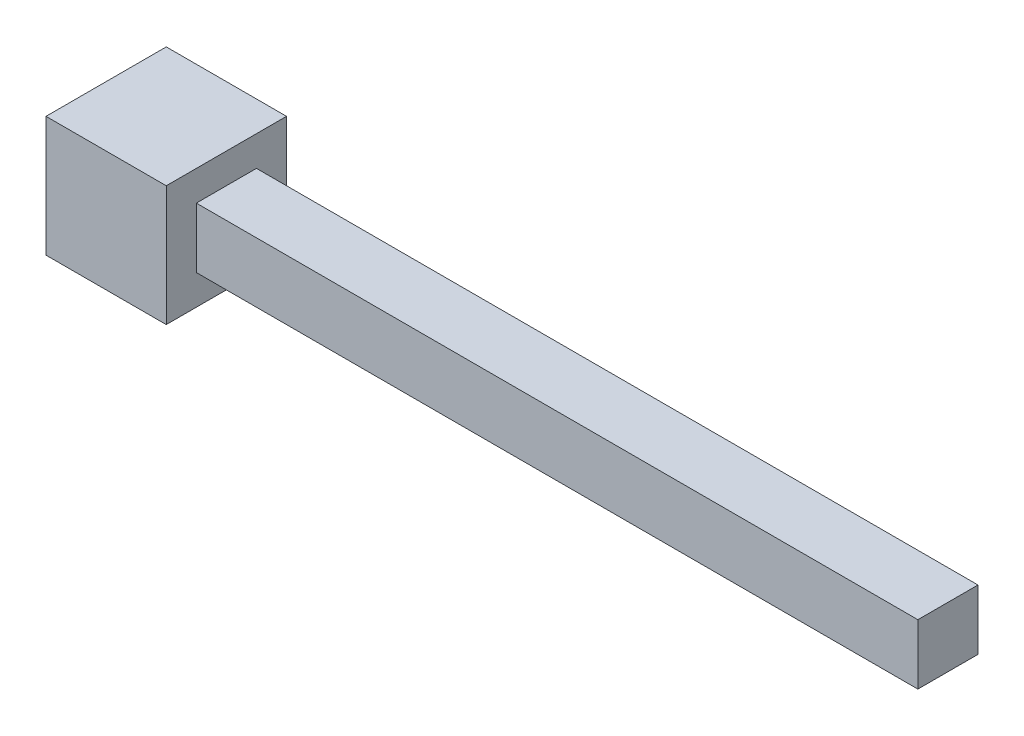
ISO-10303-21;
HEADER;
FILE_DESCRIPTION(('STEP AP214'),'2;1');
FILE_NAME('part.step','',(''),(''),'','','');
FILE_SCHEMA(('AUTOMOTIVE_DESIGN { 1 0 10303 214 1 1 1 1 }'));
ENDSEC;
DATA;
#1=APPLICATION_CONTEXT('core data for automotive mechanical design processes');
#2=APPLICATION_PROTOCOL_DEFINITION('international standard','automotive_design',2000,#1);
#3=PRODUCT_CONTEXT('',#1,'mechanical');
#4=PRODUCT('Part','Part','',(#3));
#5=PRODUCT_RELATED_PRODUCT_CATEGORY('part','',(#4));
#6=PRODUCT_DEFINITION_FORMATION('','',#4);
#7=PRODUCT_DEFINITION_CONTEXT('part definition',#1,'design');
#8=PRODUCT_DEFINITION('design','',#6,#7);
#9=PRODUCT_DEFINITION_SHAPE('','',#8);
#10=(LENGTH_UNIT() NAMED_UNIT(*) SI_UNIT(.MILLI.,.METRE.));
#11=(NAMED_UNIT(*) PLANE_ANGLE_UNIT() SI_UNIT($,.RADIAN.));
#12=(NAMED_UNIT(*) SI_UNIT($,.STERADIAN.) SOLID_ANGLE_UNIT());
#13=UNCERTAINTY_MEASURE_WITH_UNIT(LENGTH_MEASURE(1.E-05),#10,'distance_accuracy_value','');
#14=(GEOMETRIC_REPRESENTATION_CONTEXT(3) GLOBAL_UNCERTAINTY_ASSIGNED_CONTEXT((#13)) GLOBAL_UNIT_ASSIGNED_CONTEXT((#10,
#11,#12)) REPRESENTATION_CONTEXT('',''));
#15=CARTESIAN_POINT('',(0.,0.,0.));
#16=DIRECTION('',(0.,0.,1.));
#17=DIRECTION('',(1.,0.,0.));
#18=AXIS2_PLACEMENT_3D('',#15,#16,#17);
#19=CARTESIAN_POINT('',(-38.1,-11.0963113985984,25.4));
#20=DIRECTION('',(-1.,0.,0.));
#21=DIRECTION('',(0.,0.,1.));
#22=AXIS2_PLACEMENT_3D('',#19,#20,#21);
#23=PLANE('',#22);
#24=DIRECTION('',(0.,1.,0.));
#25=VECTOR('',#24,1.);
#26=CARTESIAN_POINT('',(-38.1,-11.0963113985984,0.));
#27=LINE('',#26,#25);
#28=CARTESIAN_POINT('',(-38.1,-11.0963113985984,0.));
#29=VERTEX_POINT('',#28);
#30=CARTESIAN_POINT('',(-38.1,14.3036886014016,0.));
#31=VERTEX_POINT('',#30);
#32=EDGE_CURVE('E124',#29,#31,#27,.T.);
#33=ORIENTED_EDGE('',*,*,#32,.T.);
#34=DIRECTION('',(0.,0.,-1.));
#35=VECTOR('',#34,1.);
#36=CARTESIAN_POINT('',(-38.1,14.3036886014016,25.4));
#37=LINE('',#36,#35);
#38=CARTESIAN_POINT('',(-38.1,14.3036886014016,25.4));
#39=VERTEX_POINT('',#38);
#40=EDGE_CURVE('E11',#39,#31,#37,.T.);
#41=ORIENTED_EDGE('',*,*,#40,.F.);
#42=DIRECTION('',(0.,1.,0.));
#43=VECTOR('',#42,1.);
#44=CARTESIAN_POINT('',(-38.1,-11.0963113985984,25.4));
#45=LINE('',#44,#43);
#46=CARTESIAN_POINT('',(-38.1,-11.0963113985984,25.4));
#47=VERTEX_POINT('',#46);
#48=EDGE_CURVE('E133',#47,#39,#45,.T.);
#49=ORIENTED_EDGE('',*,*,#48,.F.);
#50=DIRECTION('',(0.,0.,-1.));
#51=VECTOR('',#50,1.);
#52=CARTESIAN_POINT('',(-38.1,-11.0963113985984,25.4));
#53=LINE('',#52,#51);
#54=EDGE_CURVE('E142',#47,#29,#53,.T.);
#55=ORIENTED_EDGE('',*,*,#54,.T.);
#56=EDGE_LOOP('',(#33,#41,#49,#55));
#57=FACE_BOUND('',#56,.T.);
#58=DIRECTION('',(0.,1.,0.));
#59=VECTOR('',#58,1.);
#60=CARTESIAN_POINT('',(-38.1,-4.74631139859837,6.35));
#61=LINE('',#60,#59);
#62=CARTESIAN_POINT('',(-38.1,-4.74631139859837,6.35));
#63=VERTEX_POINT('',#62);
#64=CARTESIAN_POINT('',(-38.1,7.95368860140163,6.35));
#65=VERTEX_POINT('',#64);
#66=EDGE_CURVE('E54',#63,#65,#61,.T.);
#67=ORIENTED_EDGE('',*,*,#66,.F.);
#68=DIRECTION('',(0.,0.,-1.));
#69=VECTOR('',#68,1.);
#70=CARTESIAN_POINT('',(-38.1,-4.74631139859837,19.05));
#71=LINE('',#70,#69);
#72=CARTESIAN_POINT('',(-38.1,-4.74631139859837,19.05));
#73=VERTEX_POINT('',#72);
#74=EDGE_CURVE('E58',#73,#63,#71,.T.);
#75=ORIENTED_EDGE('',*,*,#74,.F.);
#76=DIRECTION('',(0.,-1.,0.));
#77=VECTOR('',#76,1.);
#78=CARTESIAN_POINT('',(-38.1,-4.74631139859837,19.05));
#79=LINE('',#78,#77);
#80=CARTESIAN_POINT('',(-38.1,7.95368860140163,19.05));
#81=VERTEX_POINT('',#80);
#82=EDGE_CURVE('E267',#81,#73,#79,.T.);
#83=ORIENTED_EDGE('',*,*,#82,.F.);
#84=DIRECTION('',(0.,0.,1.));
#85=VECTOR('',#84,1.);
#86=CARTESIAN_POINT('',(-38.1,7.95368860140163,19.05));
#87=LINE('',#86,#85);
#88=EDGE_CURVE('E273',#65,#81,#87,.T.);
#89=ORIENTED_EDGE('',*,*,#88,.F.);
#90=EDGE_LOOP('',(#67,#75,#83,#89));
#91=FACE_BOUND('',#90,.T.);
#92=ADVANCED_FACE('F40',(#57,#91),#23,.F.);
#93=CARTESIAN_POINT('',(-63.5,14.3036886014016,25.4));
#94=DIRECTION('',(0.,-1.,0.));
#95=DIRECTION('',(0.,0.,-1.));
#96=AXIS2_PLACEMENT_3D('',#93,#94,#95);
#97=PLANE('',#96);
#98=DIRECTION('',(-1.,0.,0.));
#99=VECTOR('',#98,1.);
#100=CARTESIAN_POINT('',(-63.5,14.3036886014016,0.));
#101=LINE('',#100,#99);
#102=CARTESIAN_POINT('',(-63.5,14.3036886014016,0.));
#103=VERTEX_POINT('',#102);
#104=EDGE_CURVE('E127',#31,#103,#101,.T.);
#105=ORIENTED_EDGE('',*,*,#104,.T.);
#106=DIRECTION('',(0.,0.,-1.));
#107=VECTOR('',#106,1.);
#108=CARTESIAN_POINT('',(-63.5,14.3036886014016,25.4));
#109=LINE('',#108,#107);
#110=CARTESIAN_POINT('',(-63.5,14.3036886014016,25.4));
#111=VERTEX_POINT('',#110);
#112=EDGE_CURVE('E47',#111,#103,#109,.T.);
#113=ORIENTED_EDGE('',*,*,#112,.F.);
#114=DIRECTION('',(-1.,0.,0.));
#115=VECTOR('',#114,1.);
#116=CARTESIAN_POINT('',(-63.5,14.3036886014016,25.4));
#117=LINE('',#116,#115);
#118=EDGE_CURVE('E136',#39,#111,#117,.T.);
#119=ORIENTED_EDGE('',*,*,#118,.F.);
#120=ORIENTED_EDGE('',*,*,#40,.T.);
#121=EDGE_LOOP('',(#105,#113,#119,#120));
#122=FACE_BOUND('',#121,.T.);
#123=ADVANCED_FACE('F173',(#122),#97,.F.);
#124=CARTESIAN_POINT('',(-63.5,-11.0963113985984,25.4));
#125=DIRECTION('',(1.,0.,0.));
#126=DIRECTION('',(0.,0.,-1.));
#127=AXIS2_PLACEMENT_3D('',#124,#125,#126);
#128=PLANE('',#127);
#129=DIRECTION('',(0.,-1.,0.));
#130=VECTOR('',#129,1.);
#131=CARTESIAN_POINT('',(-63.5,-11.0963113985984,0.));
#132=LINE('',#131,#130);
#133=CARTESIAN_POINT('',(-63.5,-11.0963113985984,0.));
#134=VERTEX_POINT('',#133);
#135=EDGE_CURVE('E145',#103,#134,#132,.T.);
#136=ORIENTED_EDGE('',*,*,#135,.T.);
#137=DIRECTION('',(0.,0.,-1.));
#138=VECTOR('',#137,1.);
#139=CARTESIAN_POINT('',(-63.5,-11.0963113985984,25.4));
#140=LINE('',#139,#138);
#141=CARTESIAN_POINT('',(-63.5,-11.0963113985984,25.4));
#142=VERTEX_POINT('',#141);
#143=EDGE_CURVE('E150',#142,#134,#140,.T.);
#144=ORIENTED_EDGE('',*,*,#143,.F.);
#145=DIRECTION('',(0.,-1.,0.));
#146=VECTOR('',#145,1.);
#147=CARTESIAN_POINT('',(-63.5,-11.0963113985984,25.4));
#148=LINE('',#147,#146);
#149=EDGE_CURVE('E139',#111,#142,#148,.T.);
#150=ORIENTED_EDGE('',*,*,#149,.F.);
#151=ORIENTED_EDGE('',*,*,#112,.T.);
#152=EDGE_LOOP('',(#136,#144,#150,#151));
#153=FACE_BOUND('',#152,.T.);
#154=ADVANCED_FACE('F157',(#153),#128,.F.);
#155=CARTESIAN_POINT('',(-63.5,-11.0963113985984,25.4));
#156=DIRECTION('',(0.,1.,0.));
#157=DIRECTION('',(0.,0.,1.));
#158=AXIS2_PLACEMENT_3D('',#155,#156,#157);
#159=PLANE('',#158);
#160=DIRECTION('',(1.,0.,0.));
#161=VECTOR('',#160,1.);
#162=CARTESIAN_POINT('',(-63.5,-11.0963113985984,0.));
#163=LINE('',#162,#161);
#164=EDGE_CURVE('E137',#134,#29,#163,.T.);
#165=ORIENTED_EDGE('',*,*,#164,.T.);
#166=ORIENTED_EDGE('',*,*,#54,.F.);
#167=DIRECTION('',(1.,0.,0.));
#168=VECTOR('',#167,1.);
#169=CARTESIAN_POINT('',(-63.5,-11.0963113985984,25.4));
#170=LINE('',#169,#168);
#171=EDGE_CURVE('E141',#142,#47,#170,.T.);
#172=ORIENTED_EDGE('',*,*,#171,.F.);
#173=ORIENTED_EDGE('',*,*,#143,.T.);
#174=EDGE_LOOP('',(#165,#166,#172,#173));
#175=FACE_BOUND('',#174,.T.);
#176=ADVANCED_FACE('F166',(#175),#159,.F.);
#177=CARTESIAN_POINT('',(0.,0.,25.4));
#178=DIRECTION('',(0.,0.,-1.));
#179=DIRECTION('',(-1.,0.,0.));
#180=AXIS2_PLACEMENT_3D('',#177,#178,#179);
#181=PLANE('',#180);
#182=ORIENTED_EDGE('',*,*,#48,.T.);
#183=ORIENTED_EDGE('',*,*,#118,.T.);
#184=ORIENTED_EDGE('',*,*,#149,.T.);
#185=ORIENTED_EDGE('',*,*,#171,.T.);
#186=EDGE_LOOP('',(#182,#183,#184,#185));
#187=FACE_BOUND('',#186,.T.);
#188=ADVANCED_FACE('F172',(#187),#181,.F.);
#189=CARTESIAN_POINT('',(0.,0.,0.));
#190=DIRECTION('',(0.,0.,-1.));
#191=DIRECTION('',(-1.,0.,0.));
#192=AXIS2_PLACEMENT_3D('',#189,#190,#191);
#193=PLANE('',#192);
#194=ORIENTED_EDGE('',*,*,#32,.F.);
#195=ORIENTED_EDGE('',*,*,#164,.F.);
#196=ORIENTED_EDGE('',*,*,#135,.F.);
#197=ORIENTED_EDGE('',*,*,#104,.F.);
#198=EDGE_LOOP('',(#194,#195,#196,#197));
#199=FACE_BOUND('',#198,.T.);
#200=ADVANCED_FACE('F163',(#199),#193,.T.);
#201=CARTESIAN_POINT('',(114.3,-4.74631139859837,6.35));
#202=DIRECTION('',(0.,0.,1.));
#203=DIRECTION('',(1.,0.,0.));
#204=AXIS2_PLACEMENT_3D('',#201,#202,#203);
#205=PLANE('',#204);
#206=ORIENTED_EDGE('',*,*,#66,.T.);
#207=DIRECTION('',(-1.,0.,0.));
#208=VECTOR('',#207,1.);
#209=CARTESIAN_POINT('',(114.3,7.95368860140163,6.35));
#210=LINE('',#209,#208);
#211=CARTESIAN_POINT('',(114.3,7.95368860140163,6.35));
#212=VERTEX_POINT('',#211);
#213=EDGE_CURVE('E107',#212,#65,#210,.T.);
#214=ORIENTED_EDGE('',*,*,#213,.F.);
#215=DIRECTION('',(0.,1.,0.));
#216=VECTOR('',#215,1.);
#217=CARTESIAN_POINT('',(114.3,-4.74631139859837,6.35));
#218=LINE('',#217,#216);
#219=CARTESIAN_POINT('',(114.3,-4.74631139859837,6.35));
#220=VERTEX_POINT('',#219);
#221=EDGE_CURVE('E113',#220,#212,#218,.T.);
#222=ORIENTED_EDGE('',*,*,#221,.F.);
#223=DIRECTION('',(-1.,0.,0.));
#224=VECTOR('',#223,1.);
#225=CARTESIAN_POINT('',(114.3,-4.74631139859837,6.35));
#226=LINE('',#225,#224);
#227=EDGE_CURVE('E265',#220,#63,#226,.T.);
#228=ORIENTED_EDGE('',*,*,#227,.T.);
#229=EDGE_LOOP('',(#206,#214,#222,#228));
#230=FACE_BOUND('',#229,.T.);
#231=ADVANCED_FACE('F123',(#230),#205,.F.);
#232=CARTESIAN_POINT('',(114.3,7.95368860140163,19.05));
#233=DIRECTION('',(0.,-1.,0.));
#234=DIRECTION('',(0.,0.,-1.));
#235=AXIS2_PLACEMENT_3D('',#232,#233,#234);
#236=PLANE('',#235);
#237=ORIENTED_EDGE('',*,*,#88,.T.);
#238=DIRECTION('',(-1.,0.,0.));
#239=VECTOR('',#238,1.);
#240=CARTESIAN_POINT('',(114.3,7.95368860140163,19.05));
#241=LINE('',#240,#239);
#242=CARTESIAN_POINT('',(114.3,7.95368860140163,19.05));
#243=VERTEX_POINT('',#242);
#244=EDGE_CURVE('E109',#243,#81,#241,.T.);
#245=ORIENTED_EDGE('',*,*,#244,.F.);
#246=DIRECTION('',(0.,0.,1.));
#247=VECTOR('',#246,1.);
#248=CARTESIAN_POINT('',(114.3,7.95368860140163,19.05));
#249=LINE('',#248,#247);
#250=EDGE_CURVE('E102',#212,#243,#249,.T.);
#251=ORIENTED_EDGE('',*,*,#250,.F.);
#252=ORIENTED_EDGE('',*,*,#213,.T.);
#253=EDGE_LOOP('',(#237,#245,#251,#252));
#254=FACE_BOUND('',#253,.T.);
#255=ADVANCED_FACE('F105',(#254),#236,.F.);
#256=CARTESIAN_POINT('',(114.3,-4.74631139859837,19.05));
#257=DIRECTION('',(0.,0.,-1.));
#258=DIRECTION('',(-1.,0.,0.));
#259=AXIS2_PLACEMENT_3D('',#256,#257,#258);
#260=PLANE('',#259);
#261=ORIENTED_EDGE('',*,*,#82,.T.);
#262=DIRECTION('',(-1.,0.,0.));
#263=VECTOR('',#262,1.);
#264=CARTESIAN_POINT('',(114.3,-4.74631139859837,19.05));
#265=LINE('',#264,#263);
#266=CARTESIAN_POINT('',(114.3,-4.74631139859837,19.05));
#267=VERTEX_POINT('',#266);
#268=EDGE_CURVE('E129',#267,#73,#265,.T.);
#269=ORIENTED_EDGE('',*,*,#268,.F.);
#270=DIRECTION('',(0.,-1.,0.));
#271=VECTOR('',#270,1.);
#272=CARTESIAN_POINT('',(114.3,-4.74631139859837,19.05));
#273=LINE('',#272,#271);
#274=EDGE_CURVE('E112',#243,#267,#273,.T.);
#275=ORIENTED_EDGE('',*,*,#274,.F.);
#276=ORIENTED_EDGE('',*,*,#244,.T.);
#277=EDGE_LOOP('',(#261,#269,#275,#276));
#278=FACE_BOUND('',#277,.T.);
#279=ADVANCED_FACE('F191',(#278),#260,.F.);
#280=CARTESIAN_POINT('',(114.3,-4.74631139859837,19.05));
#281=DIRECTION('',(0.,1.,0.));
#282=DIRECTION('',(0.,0.,1.));
#283=AXIS2_PLACEMENT_3D('',#280,#281,#282);
#284=PLANE('',#283);
#285=ORIENTED_EDGE('',*,*,#74,.T.);
#286=ORIENTED_EDGE('',*,*,#227,.F.);
#287=DIRECTION('',(0.,0.,-1.));
#288=VECTOR('',#287,1.);
#289=CARTESIAN_POINT('',(114.3,-4.74631139859837,19.05));
#290=LINE('',#289,#288);
#291=EDGE_CURVE('E118',#267,#220,#290,.T.);
#292=ORIENTED_EDGE('',*,*,#291,.F.);
#293=ORIENTED_EDGE('',*,*,#268,.T.);
#294=EDGE_LOOP('',(#285,#286,#292,#293));
#295=FACE_BOUND('',#294,.T.);
#296=ADVANCED_FACE('F194',(#295),#284,.F.);
#297=CARTESIAN_POINT('',(114.3,0.,0.));
#298=DIRECTION('',(-1.,0.,0.));
#299=DIRECTION('',(0.,0.,1.));
#300=AXIS2_PLACEMENT_3D('',#297,#298,#299);
#301=PLANE('',#300);
#302=ORIENTED_EDGE('',*,*,#221,.T.);
#303=ORIENTED_EDGE('',*,*,#250,.T.);
#304=ORIENTED_EDGE('',*,*,#274,.T.);
#305=ORIENTED_EDGE('',*,*,#291,.T.);
#306=EDGE_LOOP('',(#302,#303,#304,#305));
#307=FACE_BOUND('',#306,.T.);
#308=ADVANCED_FACE('F116',(#307),#301,.F.);
#309=CLOSED_SHELL('',(#92,#123,#154,#176,#188,#200,#231,#255,#279,#296,#308));
#310=MANIFOLD_SOLID_BREP('B2',#309);
#311=ADVANCED_BREP_SHAPE_REPRESENTATION('',(#18,#310),#14);
#312=SHAPE_DEFINITION_REPRESENTATION(#9,#311);
ENDSEC;
END-ISO-10303-21;
